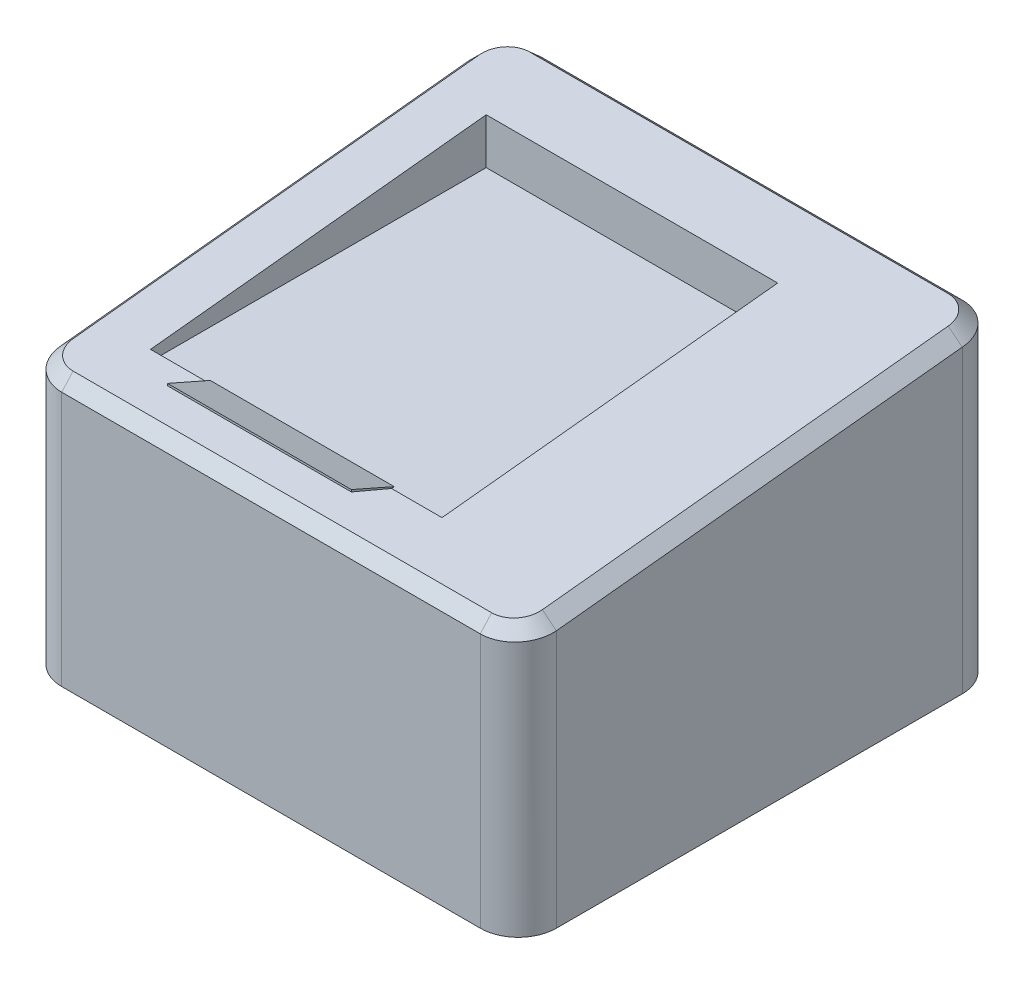
ISO-10303-21;
HEADER;
FILE_DESCRIPTION(('STEP AP214'),'2;1');
FILE_NAME('part.step','',(''),(''),'','','');
FILE_SCHEMA(('AUTOMOTIVE_DESIGN { 1 0 10303 214 1 1 1 1 }'));
ENDSEC;
DATA;
#1=APPLICATION_CONTEXT('core data for automotive mechanical design processes');
#2=APPLICATION_PROTOCOL_DEFINITION('international standard','automotive_design',2000,#1);
#3=PRODUCT_CONTEXT('',#1,'mechanical');
#4=PRODUCT('Part','Part','',(#3));
#5=PRODUCT_RELATED_PRODUCT_CATEGORY('part','',(#4));
#6=PRODUCT_DEFINITION_FORMATION('','',#4);
#7=PRODUCT_DEFINITION_CONTEXT('part definition',#1,'design');
#8=PRODUCT_DEFINITION('design','',#6,#7);
#9=PRODUCT_DEFINITION_SHAPE('','',#8);
#10=(LENGTH_UNIT() NAMED_UNIT(*) SI_UNIT(.MILLI.,.METRE.));
#11=(NAMED_UNIT(*) PLANE_ANGLE_UNIT() SI_UNIT($,.RADIAN.));
#12=(NAMED_UNIT(*) SI_UNIT($,.STERADIAN.) SOLID_ANGLE_UNIT());
#13=UNCERTAINTY_MEASURE_WITH_UNIT(LENGTH_MEASURE(1.E-05),#10,'distance_accuracy_value','');
#14=(GEOMETRIC_REPRESENTATION_CONTEXT(3) GLOBAL_UNCERTAINTY_ASSIGNED_CONTEXT((#13)) GLOBAL_UNIT_ASSIGNED_CONTEXT((#10,
#11,#12)) REPRESENTATION_CONTEXT('',''));
#15=CARTESIAN_POINT('',(0.,0.,0.));
#16=DIRECTION('',(0.,0.,1.));
#17=DIRECTION('',(1.,0.,0.));
#18=AXIS2_PLACEMENT_3D('',#15,#16,#17);
#19=CARTESIAN_POINT('',(-100.,215.485626080053,137.886552239496));
#20=DIRECTION('',(0.,-0.994505452921406,-0.104684784518048));
#21=DIRECTION('',(0.,0.104684784518048,-0.994505452921406));
#22=AXIS2_PLACEMENT_3D('',#19,#20,#21);
#23=PLANE('',#22);
#24=DIRECTION('',(1.,0.,0.));
#25=VECTOR('',#24,1.);
#26=CARTESIAN_POINT('',(-100.,215.485626080053,137.886552239496));
#27=LINE('',#26,#25);
#28=CARTESIAN_POINT('',(-100.,215.485626080053,137.886552239496));
#29=VERTEX_POINT('',#28);
#30=CARTESIAN_POINT('',(45.,215.485626080053,137.886552239496));
#31=VERTEX_POINT('',#30);
#32=EDGE_CURVE('E51',#29,#31,#27,.T.);
#33=ORIENTED_EDGE('',*,*,#32,.T.);
#34=DIRECTION('',(0.,0.104684784518048,-0.994505452921405));
#35=VECTOR('',#34,1.);
#36=CARTESIAN_POINT('',(45.,215.485626080053,137.886552239496));
#37=LINE('',#36,#35);
#38=CARTESIAN_POINT('',(45.,215.263157894737,140.));
#39=VERTEX_POINT('',#38);
#40=EDGE_CURVE('E88',#39,#31,#37,.T.);
#41=ORIENTED_EDGE('',*,*,#40,.F.);
#42=DIRECTION('',(1.,0.,0.));
#43=VECTOR('',#42,1.);
#44=CARTESIAN_POINT('',(-100.,215.263157894737,140.));
#45=LINE('',#44,#43);
#46=CARTESIAN_POINT('',(-100.,215.263157894737,140.));
#47=VERTEX_POINT('',#46);
#48=EDGE_CURVE('E12',#47,#39,#45,.T.);
#49=ORIENTED_EDGE('',*,*,#48,.F.);
#50=DIRECTION('',(0.,0.104684784518048,-0.994505452921405));
#51=VECTOR('',#50,1.);
#52=CARTESIAN_POINT('',(-100.,215.485626080053,137.886552239496));
#53=LINE('',#52,#51);
#54=EDGE_CURVE('E89',#47,#29,#53,.T.);
#55=ORIENTED_EDGE('',*,*,#54,.T.);
#56=EDGE_LOOP('',(#33,#41,#49,#55));
#57=FACE_BOUND('',#56,.T.);
#58=ADVANCED_FACE('F48',(#57),#23,.T.);
#59=CARTESIAN_POINT('',(-100.,215.263157894737,140.));
#60=DIRECTION('',(0.,-0.920273137983253,0.391276566518436));
#61=DIRECTION('',(0.,-0.391276566518436,-0.920273137983253));
#62=AXIS2_PLACEMENT_3D('',#59,#60,#61);
#63=PLANE('',#62);
#64=ORIENTED_EDGE('',*,*,#48,.T.);
#65=DIRECTION('',(0.,-0.391276566518436,-0.920273137983253));
#66=VECTOR('',#65,1.);
#67=CARTESIAN_POINT('',(45.,215.263157894737,140.));
#68=LINE('',#67,#66);
#69=CARTESIAN_POINT('',(45.,228.713079158669,171.63389353296));
#70=VERTEX_POINT('',#69);
#71=EDGE_CURVE('E105',#70,#39,#68,.T.);
#72=ORIENTED_EDGE('',*,*,#71,.F.);
#73=DIRECTION('',(1.,0.,0.));
#74=VECTOR('',#73,1.);
#75=CARTESIAN_POINT('',(-100.,228.713079158669,171.63389353296));
#76=LINE('',#75,#74);
#77=CARTESIAN_POINT('',(-100.,228.713079158669,171.63389353296));
#78=VERTEX_POINT('',#77);
#79=EDGE_CURVE('E56',#78,#70,#76,.T.);
#80=ORIENTED_EDGE('',*,*,#79,.F.);
#81=DIRECTION('',(0.,-0.391276566518436,-0.920273137983253));
#82=VECTOR('',#81,1.);
#83=CARTESIAN_POINT('',(-100.,215.263157894737,140.));
#84=LINE('',#83,#82);
#85=EDGE_CURVE('E94',#78,#47,#84,.T.);
#86=ORIENTED_EDGE('',*,*,#85,.T.);
#87=EDGE_LOOP('',(#64,#72,#80,#86));
#88=FACE_BOUND('',#87,.T.);
#89=ADVANCED_FACE('F120',(#88),#63,.T.);
#90=CARTESIAN_POINT('',(-100.,228.713079158669,171.63389353296));
#91=DIRECTION('',(0.,0.,1.));
#92=DIRECTION('',(0.,-1.,0.));
#93=AXIS2_PLACEMENT_3D('',#90,#91,#92);
#94=PLANE('',#93);
#95=ORIENTED_EDGE('',*,*,#79,.T.);
#96=DIRECTION('',(0.,-1.,0.));
#97=VECTOR('',#96,1.);
#98=CARTESIAN_POINT('',(45.,228.713079158669,171.63389353296));
#99=LINE('',#98,#97);
#100=CARTESIAN_POINT('',(45.,230.345676999978,171.63389353296));
#101=VERTEX_POINT('',#100);
#102=EDGE_CURVE('E101',#101,#70,#99,.T.);
#103=ORIENTED_EDGE('',*,*,#102,.F.);
#104=DIRECTION('',(1.,0.,0.));
#105=VECTOR('',#104,1.);
#106=CARTESIAN_POINT('',(-100.,230.345676999978,171.63389353296));
#107=LINE('',#106,#105);
#108=CARTESIAN_POINT('',(-100.,230.345676999978,171.63389353296));
#109=VERTEX_POINT('',#108);
#110=EDGE_CURVE('E93',#109,#101,#107,.T.);
#111=ORIENTED_EDGE('',*,*,#110,.F.);
#112=DIRECTION('',(0.,-1.,0.));
#113=VECTOR('',#112,1.);
#114=CARTESIAN_POINT('',(-100.,228.713079158669,171.63389353296));
#115=LINE('',#114,#113);
#116=EDGE_CURVE('E113',#109,#78,#115,.T.);
#117=ORIENTED_EDGE('',*,*,#116,.T.);
#118=EDGE_LOOP('',(#95,#103,#111,#117));
#119=FACE_BOUND('',#118,.T.);
#120=ADVANCED_FACE('F117',(#119),#94,.T.);
#121=CARTESIAN_POINT('',(-100.,230.345676999978,171.63389353296));
#122=DIRECTION('',(0.,0.915202822566064,-0.402993540354072));
#123=DIRECTION('',(0.,0.402993540354072,0.915202822566064));
#124=AXIS2_PLACEMENT_3D('',#121,#122,#123);
#125=PLANE('',#124);
#126=ORIENTED_EDGE('',*,*,#110,.T.);
#127=DIRECTION('',(0.,0.402993540354072,0.915202822566064));
#128=VECTOR('',#127,1.);
#129=CARTESIAN_POINT('',(45.,230.345676999978,171.63389353296));
#130=LINE('',#129,#128);
#131=EDGE_CURVE('E96',#31,#101,#130,.T.);
#132=ORIENTED_EDGE('',*,*,#131,.F.);
#133=ORIENTED_EDGE('',*,*,#32,.F.);
#134=DIRECTION('',(0.,0.402993540354072,0.915202822566064));
#135=VECTOR('',#134,1.);
#136=CARTESIAN_POINT('',(-100.,230.345676999978,171.63389353296));
#137=LINE('',#136,#135);
#138=EDGE_CURVE('E111',#29,#109,#137,.T.);
#139=ORIENTED_EDGE('',*,*,#138,.T.);
#140=EDGE_LOOP('',(#126,#132,#133,#139));
#141=FACE_BOUND('',#140,.T.);
#142=ADVANCED_FACE('F97',(#141),#125,.T.);
#143=CARTESIAN_POINT('',(-100.,211.933274364951,171.63389353296));
#144=DIRECTION('',(-1.,0.,0.));
#145=DIRECTION('',(0.,0.,1.));
#146=AXIS2_PLACEMENT_3D('',#143,#144,#145);
#147=PLANE('',#146);
#148=ORIENTED_EDGE('',*,*,#54,.F.);
#149=ORIENTED_EDGE('',*,*,#85,.F.);
#150=ORIENTED_EDGE('',*,*,#116,.F.);
#151=ORIENTED_EDGE('',*,*,#138,.F.);
#152=EDGE_LOOP('',(#148,#149,#150,#151));
#153=FACE_BOUND('',#152,.T.);
#154=ADVANCED_FACE('F122',(#153),#147,.T.);
#155=CARTESIAN_POINT('',(45.,211.933274364951,171.63389353296));
#156=DIRECTION('',(-1.,0.,0.));
#157=DIRECTION('',(0.,0.,1.));
#158=AXIS2_PLACEMENT_3D('',#155,#156,#157);
#159=PLANE('',#158);
#160=ORIENTED_EDGE('',*,*,#40,.T.);
#161=ORIENTED_EDGE('',*,*,#131,.T.);
#162=ORIENTED_EDGE('',*,*,#102,.T.);
#163=ORIENTED_EDGE('',*,*,#71,.T.);
#164=EDGE_LOOP('',(#160,#161,#162,#163));
#165=FACE_BOUND('',#164,.T.);
#166=ADVANCED_FACE('F104',(#165),#159,.F.);
#167=CLOSED_SHELL('',(#58,#89,#120,#142,#154,#166));
#168=MANIFOLD_SOLID_BREP('B2',#167);
#169=CARTESIAN_POINT('',(195.,250.,190.));
#170=DIRECTION('',(-1.,0.,0.));
#171=DIRECTION('',(0.,0.,1.));
#172=AXIS2_PLACEMENT_3D('',#169,#170,#171);
#173=PLANE('',#172);
#174=DIRECTION('',(0.,-1.,0.));
#175=VECTOR('',#174,1.);
#176=CARTESIAN_POINT('',(195.,250.,-160.));
#177=LINE('',#176,#175);
#178=CARTESIAN_POINT('',(195.,0.,-160.));
#179=VERTEX_POINT('',#178);
#180=CARTESIAN_POINT('',(195.,236.786856223925,-160.));
#181=VERTEX_POINT('',#180);
#182=EDGE_CURVE('E402',#179,#181,#177,.F.);
#183=ORIENTED_EDGE('',*,*,#182,.T.);
#184=DIRECTION('',(0.,-0.104684784518043,0.994505452921406));
#185=VECTOR('',#184,1.);
#186=CARTESIAN_POINT('',(195.,203.212840207628,158.95315215482));
#187=LINE('',#186,#185);
#188=CARTESIAN_POINT('',(195.,203.102645697609,160.));
#189=VERTEX_POINT('',#188);
#190=EDGE_CURVE('E750',#181,#189,#187,.T.);
#191=ORIENTED_EDGE('',*,*,#190,.T.);
#192=DIRECTION('',(0.,-1.,0.));
#193=VECTOR('',#192,1.);
#194=CARTESIAN_POINT('',(195.,250.,160.));
#195=LINE('',#194,#193);
#196=CARTESIAN_POINT('',(195.,0.,160.));
#197=VERTEX_POINT('',#196);
#198=EDGE_CURVE('E753',#189,#197,#195,.T.);
#199=ORIENTED_EDGE('',*,*,#198,.T.);
#200=DIRECTION('',(0.,0.,-1.));
#201=VECTOR('',#200,1.);
#202=CARTESIAN_POINT('',(195.,0.,190.));
#203=LINE('',#202,#201);
#204=EDGE_CURVE('E337',#197,#179,#203,.T.);
#205=ORIENTED_EDGE('',*,*,#204,.T.);
#206=EDGE_LOOP('',(#183,#191,#199,#205));
#207=FACE_BOUND('',#206,.T.);
#208=ADVANCED_FACE('F183',(#207),#173,.F.);
#209=CARTESIAN_POINT('',(-195.,250.,190.));
#210=DIRECTION('',(1.,0.,0.));
#211=DIRECTION('',(0.,0.,-1.));
#212=AXIS2_PLACEMENT_3D('',#209,#210,#211);
#213=PLANE('',#212);
#214=DIRECTION('',(0.,-1.,0.));
#215=VECTOR('',#214,1.);
#216=CARTESIAN_POINT('',(-195.,250.,160.));
#217=LINE('',#216,#215);
#218=CARTESIAN_POINT('',(-195.,0.,160.));
#219=VERTEX_POINT('',#218);
#220=CARTESIAN_POINT('',(-195.,203.102645697609,160.));
#221=VERTEX_POINT('',#220);
#222=EDGE_CURVE('E378',#219,#221,#217,.F.);
#223=ORIENTED_EDGE('',*,*,#222,.T.);
#224=DIRECTION('',(0.,0.104684784518043,-0.994505452921406));
#225=VECTOR('',#224,1.);
#226=CARTESIAN_POINT('',(-195.,236.897050733944,-161.04684784518));
#227=LINE('',#226,#225);
#228=CARTESIAN_POINT('',(-195.,236.786856223925,-160.));
#229=VERTEX_POINT('',#228);
#230=EDGE_CURVE('E46',#221,#229,#227,.T.);
#231=ORIENTED_EDGE('',*,*,#230,.T.);
#232=DIRECTION('',(0.,-1.,0.));
#233=VECTOR('',#232,1.);
#234=CARTESIAN_POINT('',(-195.,250.,-160.));
#235=LINE('',#234,#233);
#236=CARTESIAN_POINT('',(-195.,0.,-160.));
#237=VERTEX_POINT('',#236);
#238=EDGE_CURVE('E374',#229,#237,#235,.T.);
#239=ORIENTED_EDGE('',*,*,#238,.T.);
#240=DIRECTION('',(0.,0.,1.));
#241=VECTOR('',#240,1.);
#242=CARTESIAN_POINT('',(-195.,0.,190.));
#243=LINE('',#242,#241);
#244=EDGE_CURVE('E347',#237,#219,#243,.T.);
#245=ORIENTED_EDGE('',*,*,#244,.T.);
#246=EDGE_LOOP('',(#223,#231,#239,#245));
#247=FACE_BOUND('',#246,.T.);
#248=ADVANCED_FACE('F725',(#247),#213,.F.);
#249=CARTESIAN_POINT('',(-195.,250.,190.));
#250=DIRECTION('',(0.,0.,-1.));
#251=DIRECTION('',(-1.,0.,0.));
#252=AXIS2_PLACEMENT_3D('',#249,#250,#251);
#253=PLANE('',#252);
#254=DIRECTION('',(0.,-1.,0.));
#255=VECTOR('',#254,1.);
#256=CARTESIAN_POINT('',(165.,250.,190.));
#257=LINE('',#256,#255);
#258=CARTESIAN_POINT('',(165.,0.,190.));
#259=VERTEX_POINT('',#258);
#260=CARTESIAN_POINT('',(165.,200.997382539714,190.));
#261=VERTEX_POINT('',#260);
#262=EDGE_CURVE('E393',#259,#261,#257,.F.);
#263=ORIENTED_EDGE('',*,*,#262,.T.);
#264=DIRECTION('',(-1.,0.,0.));
#265=VECTOR('',#264,1.);
#266=CARTESIAN_POINT('',(-165.,200.997382539714,190.));
#267=LINE('',#266,#265);
#268=CARTESIAN_POINT('',(-165.,200.997382539714,190.));
#269=VERTEX_POINT('',#268);
#270=EDGE_CURVE('E212',#261,#269,#267,.T.);
#271=ORIENTED_EDGE('',*,*,#270,.T.);
#272=DIRECTION('',(0.,-1.,0.));
#273=VECTOR('',#272,1.);
#274=CARTESIAN_POINT('',(-165.,250.,190.));
#275=LINE('',#274,#273);
#276=CARTESIAN_POINT('',(-165.,0.,190.));
#277=VERTEX_POINT('',#276);
#278=EDGE_CURVE('E377',#269,#277,#275,.T.);
#279=ORIENTED_EDGE('',*,*,#278,.T.);
#280=DIRECTION('',(1.,0.,0.));
#281=VECTOR('',#280,1.);
#282=CARTESIAN_POINT('',(-195.,0.,190.));
#283=LINE('',#282,#281);
#284=EDGE_CURVE('E350',#277,#259,#283,.T.);
#285=ORIENTED_EDGE('',*,*,#284,.T.);
#286=EDGE_LOOP('',(#263,#271,#279,#285));
#287=FACE_BOUND('',#286,.T.);
#288=ADVANCED_FACE('F743',(#287),#253,.F.);
#289=CARTESIAN_POINT('',(-195.,250.,-190.));
#290=DIRECTION('',(0.,0.,1.));
#291=DIRECTION('',(1.,0.,0.));
#292=AXIS2_PLACEMENT_3D('',#289,#290,#291);
#293=PLANE('',#292);
#294=DIRECTION('',(0.,-1.,0.));
#295=VECTOR('',#294,1.);
#296=CARTESIAN_POINT('',(-165.,250.,-190.));
#297=LINE('',#296,#295);
#298=CARTESIAN_POINT('',(-165.,0.,-190.));
#299=VERTEX_POINT('',#298);
#300=CARTESIAN_POINT('',(-165.,238.89211938182,-190.));
#301=VERTEX_POINT('',#300);
#302=EDGE_CURVE('E360',#299,#301,#297,.F.);
#303=ORIENTED_EDGE('',*,*,#302,.T.);
#304=DIRECTION('',(1.,0.,0.));
#305=VECTOR('',#304,1.);
#306=CARTESIAN_POINT('',(165.,238.89211938182,-190.));
#307=LINE('',#306,#305);
#308=CARTESIAN_POINT('',(165.,238.89211938182,-190.));
#309=VERTEX_POINT('',#308);
#310=EDGE_CURVE('E773',#301,#309,#307,.T.);
#311=ORIENTED_EDGE('',*,*,#310,.T.);
#312=DIRECTION('',(0.,-1.,0.));
#313=VECTOR('',#312,1.);
#314=CARTESIAN_POINT('',(165.,250.,-190.));
#315=LINE('',#314,#313);
#316=CARTESIAN_POINT('',(165.,0.,-190.));
#317=VERTEX_POINT('',#316);
#318=EDGE_CURVE('E369',#309,#317,#315,.T.);
#319=ORIENTED_EDGE('',*,*,#318,.T.);
#320=DIRECTION('',(-1.,0.,0.));
#321=VECTOR('',#320,1.);
#322=CARTESIAN_POINT('',(-195.,0.,-190.));
#323=LINE('',#322,#321);
#324=EDGE_CURVE('E344',#317,#299,#323,.T.);
#325=ORIENTED_EDGE('',*,*,#324,.T.);
#326=EDGE_LOOP('',(#303,#311,#319,#325));
#327=FACE_BOUND('',#326,.T.);
#328=ADVANCED_FACE('F776',(#327),#293,.F.);
#329=CARTESIAN_POINT('',(195.,0.,-190.));
#330=DIRECTION('',(0.,-1.,0.));
#331=DIRECTION('',(0.,0.,-1.));
#332=AXIS2_PLACEMENT_3D('',#329,#330,#331);
#333=PLANE('',#332);
#334=ORIENTED_EDGE('',*,*,#324,.F.);
#335=CARTESIAN_POINT('',(165.,0.,-160.));
#336=DIRECTION('',(0.,-1.,0.));
#337=DIRECTION('',(0.,0.,-1.));
#338=AXIS2_PLACEMENT_3D('',#335,#336,#337);
#339=CIRCLE('',#338,30.);
#340=EDGE_CURVE('E734',#317,#179,#339,.T.);
#341=ORIENTED_EDGE('',*,*,#340,.T.);
#342=ORIENTED_EDGE('',*,*,#204,.F.);
#343=CARTESIAN_POINT('',(165.,0.,160.));
#344=DIRECTION('',(0.,-1.,0.));
#345=DIRECTION('',(0.,0.,-1.));
#346=AXIS2_PLACEMENT_3D('',#343,#344,#345);
#347=CIRCLE('',#346,30.);
#348=EDGE_CURVE('E735',#197,#259,#347,.T.);
#349=ORIENTED_EDGE('',*,*,#348,.T.);
#350=ORIENTED_EDGE('',*,*,#284,.F.);
#351=CARTESIAN_POINT('',(-165.,0.,160.));
#352=DIRECTION('',(0.,-1.,0.));
#353=DIRECTION('',(0.,0.,-1.));
#354=AXIS2_PLACEMENT_3D('',#351,#352,#353);
#355=CIRCLE('',#354,30.);
#356=EDGE_CURVE('E739',#277,#219,#355,.T.);
#357=ORIENTED_EDGE('',*,*,#356,.T.);
#358=ORIENTED_EDGE('',*,*,#244,.F.);
#359=CARTESIAN_POINT('',(-165.,0.,-160.));
#360=DIRECTION('',(0.,-1.,0.));
#361=DIRECTION('',(0.,0.,-1.));
#362=AXIS2_PLACEMENT_3D('',#359,#360,#361);
#363=CIRCLE('',#362,30.);
#364=EDGE_CURVE('E730',#237,#299,#363,.T.);
#365=ORIENTED_EDGE('',*,*,#364,.T.);
#366=EDGE_LOOP('',(#334,#341,#342,#349,#350,#357,#358,#365));
#367=FACE_BOUND('',#366,.T.);
#368=ADVANCED_FACE('F668',(#367),#333,.T.);
#369=CARTESIAN_POINT('',(250.,210.,190.));
#370=DIRECTION('',(0.,0.994505452921406,0.104684784518043));
#371=DIRECTION('',(0.,-0.104684784518043,0.994505452921406));
#372=AXIS2_PLACEMENT_3D('',#369,#370,#371);
#373=PLANE('',#372);
#374=DIRECTION('',(-1.,0.,0.));
#375=VECTOR('',#374,1.);
#376=CARTESIAN_POINT('',(-165.,248.837173911034,-178.95315215482));
#377=LINE('',#376,#375);
#378=CARTESIAN_POINT('',(165.,248.837173911034,-178.95315215482));
#379=VERTEX_POINT('',#378);
#380=CARTESIAN_POINT('',(-165.,248.837173911034,-178.95315215482));
#381=VERTEX_POINT('',#380);
#382=EDGE_CURVE('E649',#379,#381,#377,.T.);
#383=ORIENTED_EDGE('',*,*,#382,.T.);
#384=CARTESIAN_POINT('',(-185.,246.731910753139,-158.95315215482));
#385=CARTESIAN_POINT('',(-185.001394210175,247.007513573576,-161.571378948976));
#386=CARTESIAN_POINT('',(-184.479542807475,247.28293624371,-164.187894315242));
#387=CARTESIAN_POINT('',(-182.475638492977,247.792183925158,-169.025747289001));
#388=CARTESIAN_POINT('',(-180.99350180704,248.025675957394,-171.243921595242));
#389=CARTESIAN_POINT('',(-177.290769440422,248.415437259143,-174.946653961859));
#390=CARTESIAN_POINT('',(-175.072595139526,248.571451646903,-176.428790645583));
#391=CARTESIAN_POINT('',(-170.234742155078,248.782388943632,-178.432694964508));
#392=CARTESIAN_POINT('',(-167.618226794156,248.837320669999,-178.954546364995));
#393=CARTESIAN_POINT('',(-165.,248.837173911034,-178.95315215482));
#394=B_SPLINE_CURVE_WITH_KNOTS('',3,(#384,#385,#386,#387,#388,#389,#390,#391,#392,#393),
.UNSPECIFIED.,.F.,.F.,(4,2,2,2,4),(3.14159265358979,3.53429173528852,3.92699081698724,
4.31968989868597,4.71238898038469),.UNSPECIFIED.);
#395=CARTESIAN_POINT('',(-185.,246.731910753139,-158.95315215482));
#396=VERTEX_POINT('',#395);
#397=EDGE_CURVE('E642',#381,#396,#394,.F.);
#398=ORIENTED_EDGE('',*,*,#397,.T.);
#399=DIRECTION('',(0.,-0.104684784518043,0.994505452921406));
#400=VECTOR('',#399,1.);
#401=CARTESIAN_POINT('',(-185.,213.157894736842,160.));
#402=LINE('',#401,#400);
#403=CARTESIAN_POINT('',(-185.,213.047700226823,161.04684784518));
#404=VERTEX_POINT('',#403);
#405=EDGE_CURVE('E644',#396,#404,#402,.T.);
#406=ORIENTED_EDGE('',*,*,#405,.T.);
#407=CARTESIAN_POINT('',(-165.,210.942437068928,181.04684784518));
#408=CARTESIAN_POINT('',(-167.618226794156,210.942290309963,181.048242055356));
#409=CARTESIAN_POINT('',(-170.234742155078,210.99722203633,180.526390654869));
#410=CARTESIAN_POINT('',(-175.072595139526,211.208159333059,178.522486335943));
#411=CARTESIAN_POINT('',(-177.290769440422,211.364173720819,177.04034965222));
#412=CARTESIAN_POINT('',(-180.99350180704,211.753935022568,173.337617285602));
#413=CARTESIAN_POINT('',(-182.475638492977,211.987427054804,171.119442979361));
#414=CARTESIAN_POINT('',(-184.479542807475,212.496674736252,166.281590005603));
#415=CARTESIAN_POINT('',(-185.001394210175,212.772097406386,163.665074639336));
#416=CARTESIAN_POINT('',(-185.,213.047700226823,161.04684784518));
#417=B_SPLINE_CURVE_WITH_KNOTS('',3,(#407,#408,#409,#410,#411,#412,#413,#414,#415,#416),
.UNSPECIFIED.,.F.,.F.,(4,2,2,2,4),(4.71238898038469,5.10508806208341,5.49778714378214,
5.89048622548086,6.28318530717959),.UNSPECIFIED.);
#418=CARTESIAN_POINT('',(-165.,210.942437068928,181.04684784518));
#419=VERTEX_POINT('',#418);
#420=EDGE_CURVE('E645',#404,#419,#417,.F.);
#421=ORIENTED_EDGE('',*,*,#420,.T.);
#422=DIRECTION('',(1.,0.,0.));
#423=VECTOR('',#422,1.);
#424=CARTESIAN_POINT('',(165.,210.942437068928,181.04684784518));
#425=LINE('',#424,#423);
#426=CARTESIAN_POINT('',(165.,210.942437068928,181.04684784518));
#427=VERTEX_POINT('',#426);
#428=EDGE_CURVE('E600',#419,#427,#425,.T.);
#429=ORIENTED_EDGE('',*,*,#428,.T.);
#430=CARTESIAN_POINT('',(185.,213.047700226823,161.04684784518));
#431=CARTESIAN_POINT('',(185.001394210175,212.772097406386,163.665074639336));
#432=CARTESIAN_POINT('',(184.479542807475,212.496674736252,166.281590005603));
#433=CARTESIAN_POINT('',(182.475638492977,211.987427054804,171.119442979361));
#434=CARTESIAN_POINT('',(180.99350180704,211.753935022568,173.337617285603));
#435=CARTESIAN_POINT('',(177.290769440422,211.364173720819,177.04034965222));
#436=CARTESIAN_POINT('',(175.072595139525,211.208159333059,178.522486335944));
#437=CARTESIAN_POINT('',(170.234742155078,210.99722203633,180.526390654869));
#438=CARTESIAN_POINT('',(167.618226794156,210.942290309962,181.048242055356));
#439=CARTESIAN_POINT('',(165.,210.942437068928,181.04684784518));
#440=B_SPLINE_CURVE_WITH_KNOTS('',3,(#430,#431,#432,#433,#434,#435,#436,#437,#438,#439),
.UNSPECIFIED.,.F.,.F.,(4,2,2,2,4),(0.,0.392699081698723,0.785398163397447,1.17809724509617,
1.5707963267949),.UNSPECIFIED.);
#441=CARTESIAN_POINT('',(185.,213.047700226823,161.04684784518));
#442=VERTEX_POINT('',#441);
#443=EDGE_CURVE('E594',#427,#442,#440,.F.);
#444=ORIENTED_EDGE('',*,*,#443,.T.);
#445=DIRECTION('',(0.,0.104684784518043,-0.994505452921406));
#446=VECTOR('',#445,1.);
#447=CARTESIAN_POINT('',(185.,246.842105263158,-160.));
#448=LINE('',#447,#446);
#449=CARTESIAN_POINT('',(185.,246.731910753139,-158.95315215482));
#450=VERTEX_POINT('',#449);
#451=EDGE_CURVE('E599',#442,#450,#448,.T.);
#452=ORIENTED_EDGE('',*,*,#451,.T.);
#453=CARTESIAN_POINT('',(165.,248.837173911034,-178.95315215482));
#454=CARTESIAN_POINT('',(167.618226794156,248.837320669999,-178.954546364995));
#455=CARTESIAN_POINT('',(170.234742155078,248.782388943632,-178.432694964508));
#456=CARTESIAN_POINT('',(175.072595139525,248.571451646903,-176.428790645583));
#457=CARTESIAN_POINT('',(177.290769440422,248.415437259143,-174.946653961859));
#458=CARTESIAN_POINT('',(180.99350180704,248.025675957394,-171.243921595242));
#459=CARTESIAN_POINT('',(182.475638492977,247.792183925158,-169.025747289001));
#460=CARTESIAN_POINT('',(184.479542807475,247.28293624371,-164.187894315242));
#461=CARTESIAN_POINT('',(185.001394210175,247.007513573576,-161.571378948975));
#462=CARTESIAN_POINT('',(185.,246.731910753139,-158.95315215482));
#463=B_SPLINE_CURVE_WITH_KNOTS('',3,(#453,#454,#455,#456,#457,#458,#459,#460,#461,#462),
.UNSPECIFIED.,.F.,.F.,(4,2,2,2,4),(1.5707963267949,1.96349540849362,2.35619449019235,
2.74889357189107,3.14159265358979),.UNSPECIFIED.);
#464=EDGE_CURVE('E654',#450,#379,#463,.F.);
#465=ORIENTED_EDGE('',*,*,#464,.T.);
#466=EDGE_LOOP('',(#383,#398,#406,#421,#429,#444,#452,#465));
#467=FACE_BOUND('',#466,.T.);
#468=DIRECTION('',(0.,-0.104684784518043,0.994505452921406));
#469=VECTOR('',#468,1.);
#470=CARTESIAN_POINT('',(-145.,210.,190.));
#471=LINE('',#470,#469);
#472=CARTESIAN_POINT('',(-145.,243.123011405355,-124.668608350873));
#473=VERTEX_POINT('',#472);
#474=CARTESIAN_POINT('',(-145.,215.263157894737,140.));
#475=VERTEX_POINT('',#474);
#476=EDGE_CURVE('E311',#473,#475,#471,.T.);
#477=ORIENTED_EDGE('',*,*,#476,.F.);
#478=DIRECTION('',(-1.,0.,0.));
#479=VECTOR('',#478,1.);
#480=CARTESIAN_POINT('',(250.,243.123011405355,-124.668608350873));
#481=LINE('',#480,#479);
#482=CARTESIAN_POINT('',(84.795699229561,243.123011405355,-124.668608350873));
#483=VERTEX_POINT('',#482);
#484=EDGE_CURVE('E357',#483,#473,#481,.T.);
#485=ORIENTED_EDGE('',*,*,#484,.F.);
#486=DIRECTION('',(0.,0.104684784518043,-0.994505452921406));
#487=VECTOR('',#486,1.);
#488=CARTESIAN_POINT('',(84.795699229561,210.,190.));
#489=LINE('',#488,#487);
#490=CARTESIAN_POINT('',(84.795699229561,215.263157894737,140.));
#491=VERTEX_POINT('',#490);
#492=EDGE_CURVE('E355',#491,#483,#489,.T.);
#493=ORIENTED_EDGE('',*,*,#492,.F.);
#494=DIRECTION('',(1.,0.,0.));
#495=VECTOR('',#494,1.);
#496=CARTESIAN_POINT('',(250.,215.263157894737,140.));
#497=LINE('',#496,#495);
#498=EDGE_CURVE('E353',#475,#491,#497,.T.);
#499=ORIENTED_EDGE('',*,*,#498,.F.);
#500=EDGE_LOOP('',(#477,#485,#493,#499));
#501=FACE_BOUND('',#500,.T.);
#502=ADVANCED_FACE('F647',(#467,#501),#373,.T.);
#503=CARTESIAN_POINT('',(-145.,207.,140.));
#504=DIRECTION('',(-1.,0.,0.));
#505=DIRECTION('',(0.,0.,1.));
#506=AXIS2_PLACEMENT_3D('',#503,#504,#505);
#507=PLANE('',#506);
#508=ORIENTED_EDGE('',*,*,#476,.T.);
#509=DIRECTION('',(0.,1.,0.));
#510=VECTOR('',#509,1.);
#511=CARTESIAN_POINT('',(-145.,207.,140.));
#512=LINE('',#511,#510);
#513=CARTESIAN_POINT('',(-145.,207.,140.));
#514=VERTEX_POINT('',#513);
#515=EDGE_CURVE('E303',#514,#475,#512,.T.);
#516=ORIENTED_EDGE('',*,*,#515,.F.);
#517=DIRECTION('',(0.,0.,1.));
#518=VECTOR('',#517,1.);
#519=CARTESIAN_POINT('',(-145.,207.,140.));
#520=LINE('',#519,#518);
#521=CARTESIAN_POINT('',(-145.,207.,-124.668608350873));
#522=VERTEX_POINT('',#521);
#523=EDGE_CURVE('E308',#522,#514,#520,.T.);
#524=ORIENTED_EDGE('',*,*,#523,.F.);
#525=DIRECTION('',(0.,1.,0.));
#526=VECTOR('',#525,1.);
#527=CARTESIAN_POINT('',(-145.,207.,-124.668608350873));
#528=LINE('',#527,#526);
#529=EDGE_CURVE('E335',#522,#473,#528,.T.);
#530=ORIENTED_EDGE('',*,*,#529,.T.);
#531=EDGE_LOOP('',(#508,#516,#524,#530));
#532=FACE_BOUND('',#531,.T.);
#533=ADVANCED_FACE('F305',(#532),#507,.F.);
#534=CARTESIAN_POINT('',(84.795699229561,207.,-124.668608350873));
#535=DIRECTION('',(0.,0.,-1.));
#536=DIRECTION('',(-1.,0.,0.));
#537=AXIS2_PLACEMENT_3D('',#534,#535,#536);
#538=PLANE('',#537);
#539=ORIENTED_EDGE('',*,*,#484,.T.);
#540=ORIENTED_EDGE('',*,*,#529,.F.);
#541=DIRECTION('',(-1.,0.,0.));
#542=VECTOR('',#541,1.);
#543=CARTESIAN_POINT('',(84.795699229561,207.,-124.668608350873));
#544=LINE('',#543,#542);
#545=CARTESIAN_POINT('',(84.795699229561,207.,-124.668608350873));
#546=VERTEX_POINT('',#545);
#547=EDGE_CURVE('E315',#546,#522,#544,.T.);
#548=ORIENTED_EDGE('',*,*,#547,.F.);
#549=DIRECTION('',(0.,1.,0.));
#550=VECTOR('',#549,1.);
#551=CARTESIAN_POINT('',(84.795699229561,207.,-124.668608350873));
#552=LINE('',#551,#550);
#553=EDGE_CURVE('E338',#546,#483,#552,.T.);
#554=ORIENTED_EDGE('',*,*,#553,.T.);
#555=EDGE_LOOP('',(#539,#540,#548,#554));
#556=FACE_BOUND('',#555,.T.);
#557=ADVANCED_FACE('F823',(#556),#538,.F.);
#558=CARTESIAN_POINT('',(84.795699229561,207.,140.));
#559=DIRECTION('',(1.,0.,0.));
#560=DIRECTION('',(0.,0.,-1.));
#561=AXIS2_PLACEMENT_3D('',#558,#559,#560);
#562=PLANE('',#561);
#563=ORIENTED_EDGE('',*,*,#492,.T.);
#564=ORIENTED_EDGE('',*,*,#553,.F.);
#565=DIRECTION('',(0.,0.,-1.));
#566=VECTOR('',#565,1.);
#567=CARTESIAN_POINT('',(84.795699229561,207.,140.));
#568=LINE('',#567,#566);
#569=CARTESIAN_POINT('',(84.795699229561,207.,140.));
#570=VERTEX_POINT('',#569);
#571=EDGE_CURVE('E324',#570,#546,#568,.T.);
#572=ORIENTED_EDGE('',*,*,#571,.F.);
#573=DIRECTION('',(0.,1.,0.));
#574=VECTOR('',#573,1.);
#575=CARTESIAN_POINT('',(84.795699229561,207.,140.));
#576=LINE('',#575,#574);
#577=EDGE_CURVE('E314',#570,#491,#576,.T.);
#578=ORIENTED_EDGE('',*,*,#577,.T.);
#579=EDGE_LOOP('',(#563,#564,#572,#578));
#580=FACE_BOUND('',#579,.T.);
#581=ADVANCED_FACE('F829',(#580),#562,.F.);
#582=CARTESIAN_POINT('',(84.795699229561,207.,140.));
#583=DIRECTION('',(0.,0.,1.));
#584=DIRECTION('',(1.,0.,0.));
#585=AXIS2_PLACEMENT_3D('',#582,#583,#584);
#586=PLANE('',#585);
#587=ORIENTED_EDGE('',*,*,#498,.T.);
#588=ORIENTED_EDGE('',*,*,#577,.F.);
#589=DIRECTION('',(1.,0.,0.));
#590=VECTOR('',#589,1.);
#591=CARTESIAN_POINT('',(84.795699229561,207.,140.));
#592=LINE('',#591,#590);
#593=EDGE_CURVE('E318',#514,#570,#592,.T.);
#594=ORIENTED_EDGE('',*,*,#593,.F.);
#595=ORIENTED_EDGE('',*,*,#515,.T.);
#596=EDGE_LOOP('',(#587,#588,#594,#595));
#597=FACE_BOUND('',#596,.T.);
#598=ADVANCED_FACE('F319',(#597),#586,.F.);
#599=CARTESIAN_POINT('',(-145.,207.,-124.668608350873));
#600=DIRECTION('',(0.,1.,0.));
#601=DIRECTION('',(0.,0.,1.));
#602=AXIS2_PLACEMENT_3D('',#599,#600,#601);
#603=PLANE('',#602);
#604=ORIENTED_EDGE('',*,*,#523,.T.);
#605=ORIENTED_EDGE('',*,*,#593,.T.);
#606=ORIENTED_EDGE('',*,*,#571,.T.);
#607=ORIENTED_EDGE('',*,*,#547,.T.);
#608=EDGE_LOOP('',(#604,#605,#606,#607));
#609=FACE_BOUND('',#608,.T.);
#610=ADVANCED_FACE('F326',(#609),#603,.T.);
#611=CARTESIAN_POINT('',(165.,250.,-160.));
#612=DIRECTION('',(0.,-1.,0.));
#613=DIRECTION('',(0.,0.,-1.));
#614=AXIS2_PLACEMENT_3D('',#611,#612,#613);
#615=CYLINDRICAL_SURFACE('',#614,30.);
#616=ORIENTED_EDGE('',*,*,#318,.F.);
#617=CARTESIAN_POINT('',(195.,236.786856223925,-160.));
#618=CARTESIAN_POINT('',(195.002091315263,237.062459044362,-163.927340191234));
#619=CARTESIAN_POINT('',(194.219314212129,237.33788171434,-167.852113238419));
#620=CARTESIAN_POINT('',(191.213457738548,237.847129396099,-175.108892703487));
#621=CARTESIAN_POINT('',(188.990252710569,238.080621428179,-178.436154160624));
#622=CARTESIAN_POINT('',(183.436154160624,238.47038272993,-183.990252710569));
#623=CARTESIAN_POINT('',(180.108892707061,238.626397117754,-186.213457737067));
#624=CARTESIAN_POINT('',(172.852113234845,238.837334414354,-189.21931421361));
#625=CARTESIAN_POINT('',(168.927340191234,238.892266140785,-190.002091315263));
#626=CARTESIAN_POINT('',(165.,238.89211938182,-190.));
#627=B_SPLINE_CURVE_WITH_KNOTS('',3,(#617,#618,#619,#620,#621,#622,#623,#624,#625,#626),
.UNSPECIFIED.,.F.,.F.,(4,2,2,2,4),(1.5707963267949,1.96349540849362,2.35619449019235,
2.74889357189107,3.14159265358979),.UNSPECIFIED.);
#628=EDGE_CURVE('E752',#309,#181,#627,.F.);
#629=ORIENTED_EDGE('',*,*,#628,.T.);
#630=ORIENTED_EDGE('',*,*,#182,.F.);
#631=ORIENTED_EDGE('',*,*,#340,.F.);
#632=EDGE_LOOP('',(#616,#629,#630,#631));
#633=FACE_BOUND('',#632,.T.);
#634=ADVANCED_FACE('F771',(#633),#615,.T.);
#635=CARTESIAN_POINT('',(-165.,250.,-160.));
#636=DIRECTION('',(0.,-1.,0.));
#637=DIRECTION('',(0.,0.,-1.));
#638=AXIS2_PLACEMENT_3D('',#635,#636,#637);
#639=CYLINDRICAL_SURFACE('',#638,30.);
#640=ORIENTED_EDGE('',*,*,#238,.F.);
#641=CARTESIAN_POINT('',(-165.,238.89211938182,-190.));
#642=CARTESIAN_POINT('',(-168.927340191234,238.892266140785,-190.002091315263));
#643=CARTESIAN_POINT('',(-172.852113234845,238.837334414354,-189.21931421361));
#644=CARTESIAN_POINT('',(-180.10889270706,238.626397117754,-186.213457737067));
#645=CARTESIAN_POINT('',(-183.436154160624,238.47038272993,-183.990252710569));
#646=CARTESIAN_POINT('',(-188.990252710569,238.080621428179,-178.436154160624));
#647=CARTESIAN_POINT('',(-191.213457738548,237.847129396099,-175.108892703487));
#648=CARTESIAN_POINT('',(-194.219314212129,237.33788171434,-167.852113238419));
#649=CARTESIAN_POINT('',(-195.002091315263,237.062459044362,-163.927340191234));
#650=CARTESIAN_POINT('',(-195.,236.786856223925,-160.));
#651=B_SPLINE_CURVE_WITH_KNOTS('',3,(#641,#642,#643,#644,#645,#646,#647,#648,#649,#650),
.UNSPECIFIED.,.F.,.F.,(4,2,2,2,4),(3.14159265358979,3.53429173528852,3.92699081698724,
4.31968989868597,4.71238898038469),.UNSPECIFIED.);
#652=EDGE_CURVE('E643',#229,#301,#651,.F.);
#653=ORIENTED_EDGE('',*,*,#652,.T.);
#654=ORIENTED_EDGE('',*,*,#302,.F.);
#655=ORIENTED_EDGE('',*,*,#364,.F.);
#656=EDGE_LOOP('',(#640,#653,#654,#655));
#657=FACE_BOUND('',#656,.T.);
#658=ADVANCED_FACE('F728',(#657),#639,.T.);
#659=CARTESIAN_POINT('',(165.,250.,160.));
#660=DIRECTION('',(0.,-1.,0.));
#661=DIRECTION('',(0.,0.,-1.));
#662=AXIS2_PLACEMENT_3D('',#659,#660,#661);
#663=CYLINDRICAL_SURFACE('',#662,30.);
#664=ORIENTED_EDGE('',*,*,#198,.F.);
#665=CARTESIAN_POINT('',(165.,200.997382539714,190.));
#666=CARTESIAN_POINT('',(168.927340191234,200.997235780748,190.002091315263));
#667=CARTESIAN_POINT('',(172.852113234845,201.05216750718,189.21931421361));
#668=CARTESIAN_POINT('',(180.10889270706,201.26310480378,186.213457737067));
#669=CARTESIAN_POINT('',(183.436154160624,201.419119191604,183.990252710569));
#670=CARTESIAN_POINT('',(188.990252710569,201.808880493355,178.436154160624));
#671=CARTESIAN_POINT('',(191.213457738548,202.042372525435,175.108892703487));
#672=CARTESIAN_POINT('',(194.219314212129,202.551620207194,167.852113238419));
#673=CARTESIAN_POINT('',(195.002091315263,202.827042877171,163.927340191234));
#674=CARTESIAN_POINT('',(195.,203.102645697609,160.));
#675=B_SPLINE_CURVE_WITH_KNOTS('',3,(#665,#666,#667,#668,#669,#670,#671,#672,#673,#674),
.UNSPECIFIED.,.F.,.F.,(4,2,2,2,4),(0.,0.392699081698723,0.785398163397447,1.17809724509617,
1.5707963267949),.UNSPECIFIED.);
#676=EDGE_CURVE('E399',#189,#261,#675,.F.);
#677=ORIENTED_EDGE('',*,*,#676,.T.);
#678=ORIENTED_EDGE('',*,*,#262,.F.);
#679=ORIENTED_EDGE('',*,*,#348,.F.);
#680=EDGE_LOOP('',(#664,#677,#678,#679));
#681=FACE_BOUND('',#680,.T.);
#682=ADVANCED_FACE('F417',(#681),#663,.T.);
#683=CARTESIAN_POINT('',(-165.,250.,160.));
#684=DIRECTION('',(0.,-1.,0.));
#685=DIRECTION('',(0.,0.,-1.));
#686=AXIS2_PLACEMENT_3D('',#683,#684,#685);
#687=CYLINDRICAL_SURFACE('',#686,30.);
#688=ORIENTED_EDGE('',*,*,#278,.F.);
#689=CARTESIAN_POINT('',(-195.,203.102645697609,160.));
#690=CARTESIAN_POINT('',(-195.002091315263,202.827042877172,163.927340191234));
#691=CARTESIAN_POINT('',(-194.219314212129,202.551620207194,167.852113238419));
#692=CARTESIAN_POINT('',(-191.213457738548,202.042372525435,175.108892703487));
#693=CARTESIAN_POINT('',(-188.990252710569,201.808880493355,178.436154160623));
#694=CARTESIAN_POINT('',(-183.436154160624,201.419119191604,183.990252710569));
#695=CARTESIAN_POINT('',(-180.108892707061,201.26310480378,186.213457737067));
#696=CARTESIAN_POINT('',(-172.852113234845,201.05216750718,189.21931421361));
#697=CARTESIAN_POINT('',(-168.927340191234,200.997235780748,190.002091315263));
#698=CARTESIAN_POINT('',(-165.,200.997382539714,190.));
#699=B_SPLINE_CURVE_WITH_KNOTS('',3,(#689,#690,#691,#692,#693,#694,#695,#696,#697,#698),
.UNSPECIFIED.,.F.,.F.,(4,2,2,2,4),(4.71238898038469,5.10508806208341,5.49778714378214,
5.89048622548086,6.28318530717959),.UNSPECIFIED.);
#700=EDGE_CURVE('E196',#269,#221,#699,.F.);
#701=ORIENTED_EDGE('',*,*,#700,.T.);
#702=ORIENTED_EDGE('',*,*,#222,.F.);
#703=ORIENTED_EDGE('',*,*,#356,.F.);
#704=EDGE_LOOP('',(#688,#701,#702,#703));
#705=FACE_BOUND('',#704,.T.);
#706=ADVANCED_FACE('F408',(#705),#687,.T.);
#707=CARTESIAN_POINT('',(165.,210.942437068928,181.04684784518));
#708=CARTESIAN_POINT('',(167.618226794156,210.942290309962,181.048242055356));
#709=CARTESIAN_POINT('',(170.234742155078,210.99722203633,180.526390654869));
#710=CARTESIAN_POINT('',(175.072595139525,211.208159333059,178.522486335944));
#711=CARTESIAN_POINT('',(177.290769440422,211.364173720819,177.04034965222));
#712=CARTESIAN_POINT('',(180.99350180704,211.753935022568,173.337617285603));
#713=CARTESIAN_POINT('',(182.475638492977,211.987427054804,171.119442979361));
#714=CARTESIAN_POINT('',(184.479542807475,212.496674736252,166.281590005603));
#715=CARTESIAN_POINT('',(185.001394210175,212.772097406386,163.665074639336));
#716=CARTESIAN_POINT('',(185.,213.047700226823,161.04684784518));
#717=CARTESIAN_POINT('',(165.,200.997382539714,190.));
#718=CARTESIAN_POINT('',(168.927340191234,200.997235780748,190.002091315263));
#719=CARTESIAN_POINT('',(172.852113234845,201.05216750718,189.21931421361));
#720=CARTESIAN_POINT('',(180.10889270706,201.26310480378,186.213457737067));
#721=CARTESIAN_POINT('',(183.436154160624,201.419119191604,183.990252710569));
#722=CARTESIAN_POINT('',(188.990252710569,201.808880493355,178.436154160624));
#723=CARTESIAN_POINT('',(191.213457738548,202.042372525435,175.108892703487));
#724=CARTESIAN_POINT('',(194.219314212129,202.551620207194,167.852113238419));
#725=CARTESIAN_POINT('',(195.002091315263,202.827042877171,163.927340191234));
#726=CARTESIAN_POINT('',(195.,203.102645697609,160.));
#727=B_SPLINE_SURFACE_WITH_KNOTS('',1,3,((#707,#708,#709,#710,#711,#712,#713,#714,#715,#716),
(#717,#718,#719,#720,#721,#722,#723,#724,#725,#726)),.UNSPECIFIED.,.F.,.F.,.F.,(2,2),(4,2,2,2,
4),(0.,1.),(0.,0.392699081698723,0.785398163397447,1.17809724509617,1.5707963267949),.UNSPECIFIED.);
#728=CARTESIAN_POINT('',(165.,210.942437068928,181.04684784518));
#729=CARTESIAN_POINT('',(165.,200.997382539714,190.));
#730=B_SPLINE_CURVE_WITH_KNOTS('',1,(#728,#729),.UNSPECIFIED.,.F.,.F.,(2,2),(0.,1.),.UNSPECIFIED.);
#731=EDGE_CURVE('E331',#261,#427,#730,.F.);
#732=CARTESIAN_POINT('',(195.,203.102645697609,160.));
#733=CARTESIAN_POINT('',(185.,213.047700226823,161.04684784518));
#734=B_SPLINE_CURVE_WITH_KNOTS('',1,(#732,#733),.UNSPECIFIED.,.F.,.F.,(2,2),(0.,1.),.UNSPECIFIED.);
#735=EDGE_CURVE('E328',#442,#189,#734,.F.);
#736=ORIENTED_EDGE('',*,*,#731,.F.);
#737=ORIENTED_EDGE('',*,*,#676,.F.);
#738=ORIENTED_EDGE('',*,*,#735,.F.);
#739=ORIENTED_EDGE('',*,*,#443,.F.);
#740=EDGE_LOOP('',(#736,#737,#738,#739));
#741=FACE_BOUND('',#740,.T.);
#742=ADVANCED_FACE('F185',(#741),#727,.T.);
#743=CARTESIAN_POINT('',(185.,210.,190.));
#744=DIRECTION('',(0.707106781186548,0.703221549687725,0.0740233210197605));
#745=DIRECTION('',(-0.705156138073945,0.709052057987733,0.));
#746=AXIS2_PLACEMENT_3D('',#743,#744,#745);
#747=PLANE('',#746);
#748=ORIENTED_EDGE('',*,*,#735,.T.);
#749=ORIENTED_EDGE('',*,*,#190,.F.);
#750=CARTESIAN_POINT('',(185.,246.731910753139,-158.95315215482));
#751=CARTESIAN_POINT('',(195.,236.786856223925,-160.));
#752=B_SPLINE_CURVE_WITH_KNOTS('',1,(#750,#751),.UNSPECIFIED.,.F.,.F.,(2,2),(0.,1.),.UNSPECIFIED.);
#753=EDGE_CURVE('E548',#450,#181,#752,.T.);
#754=ORIENTED_EDGE('',*,*,#753,.F.);
#755=ORIENTED_EDGE('',*,*,#451,.F.);
#756=EDGE_LOOP('',(#748,#749,#754,#755));
#757=FACE_BOUND('',#756,.T.);
#758=ADVANCED_FACE('F552',(#757),#747,.T.);
#759=CARTESIAN_POINT('',(-195.,200.997382539714,190.));
#760=DIRECTION('',(0.,0.669072199198995,0.743197411364585));
#761=DIRECTION('',(0.,-0.743197411364585,0.669072199198995));
#762=AXIS2_PLACEMENT_3D('',#759,#760,#761);
#763=PLANE('',#762);
#764=ORIENTED_EDGE('',*,*,#731,.T.);
#765=ORIENTED_EDGE('',*,*,#428,.F.);
#766=CARTESIAN_POINT('',(-165.,200.997382539714,190.));
#767=CARTESIAN_POINT('',(-165.,210.942437068928,181.04684784518));
#768=B_SPLINE_CURVE_WITH_KNOTS('',1,(#766,#767),.UNSPECIFIED.,.F.,.F.,(2,2),(0.,1.),.UNSPECIFIED.);
#769=EDGE_CURVE('E628',#269,#419,#768,.T.);
#770=ORIENTED_EDGE('',*,*,#769,.F.);
#771=ORIENTED_EDGE('',*,*,#270,.F.);
#772=EDGE_LOOP('',(#764,#765,#770,#771));
#773=FACE_BOUND('',#772,.T.);
#774=ADVANCED_FACE('F517',(#773),#763,.T.);
#775=CARTESIAN_POINT('',(185.,246.731910753139,-158.95315215482));
#776=CARTESIAN_POINT('',(185.001394210175,247.007513573576,-161.571378948975));
#777=CARTESIAN_POINT('',(184.479542807475,247.28293624371,-164.187894315242));
#778=CARTESIAN_POINT('',(182.475638492977,247.792183925158,-169.025747289001));
#779=CARTESIAN_POINT('',(180.99350180704,248.025675957394,-171.243921595242));
#780=CARTESIAN_POINT('',(177.290769440422,248.415437259143,-174.946653961859));
#781=CARTESIAN_POINT('',(175.072595139525,248.571451646903,-176.428790645583));
#782=CARTESIAN_POINT('',(170.234742155078,248.782388943632,-178.432694964508));
#783=CARTESIAN_POINT('',(167.618226794156,248.837320669999,-178.954546364995));
#784=CARTESIAN_POINT('',(165.,248.837173911034,-178.95315215482));
#785=CARTESIAN_POINT('',(195.,236.786856223925,-160.));
#786=CARTESIAN_POINT('',(195.002091315263,237.062459044362,-163.927340191234));
#787=CARTESIAN_POINT('',(194.219314212129,237.33788171434,-167.852113238419));
#788=CARTESIAN_POINT('',(191.213457738548,237.847129396099,-175.108892703487));
#789=CARTESIAN_POINT('',(188.990252710569,238.080621428179,-178.436154160624));
#790=CARTESIAN_POINT('',(183.436154160624,238.47038272993,-183.990252710569));
#791=CARTESIAN_POINT('',(180.108892707061,238.626397117754,-186.213457737067));
#792=CARTESIAN_POINT('',(172.852113234845,238.837334414354,-189.21931421361));
#793=CARTESIAN_POINT('',(168.927340191234,238.892266140785,-190.002091315263));
#794=CARTESIAN_POINT('',(165.,238.89211938182,-190.));
#795=B_SPLINE_SURFACE_WITH_KNOTS('',1,3,((#775,#776,#777,#778,#779,#780,#781,#782,#783,#784),
(#785,#786,#787,#788,#789,#790,#791,#792,#793,#794)),.UNSPECIFIED.,.F.,.F.,.F.,(2,2),(4,2,2,2,
4),(0.,1.),(1.5707963267949,1.96349540849362,2.35619449019235,2.74889357189107,
3.14159265358979),.UNSPECIFIED.);
#796=CARTESIAN_POINT('',(165.,238.89211938182,-190.));
#797=CARTESIAN_POINT('',(165.,248.837173911034,-178.95315215482));
#798=B_SPLINE_CURVE_WITH_KNOTS('',1,(#796,#797),.UNSPECIFIED.,.F.,.F.,(2,2),(0.,1.),.UNSPECIFIED.);
#799=EDGE_CURVE('E501',#379,#309,#798,.F.);
#800=ORIENTED_EDGE('',*,*,#753,.T.);
#801=ORIENTED_EDGE('',*,*,#628,.F.);
#802=ORIENTED_EDGE('',*,*,#799,.F.);
#803=ORIENTED_EDGE('',*,*,#464,.F.);
#804=EDGE_LOOP('',(#800,#801,#802,#803));
#805=FACE_BOUND('',#804,.T.);
#806=ADVANCED_FACE('F506',(#805),#795,.T.);
#807=CARTESIAN_POINT('',(-185.,213.047700226823,161.04684784518));
#808=CARTESIAN_POINT('',(-185.001394210175,212.772097406386,163.665074639336));
#809=CARTESIAN_POINT('',(-184.479542807475,212.496674736252,166.281590005603));
#810=CARTESIAN_POINT('',(-182.475638492977,211.987427054804,171.119442979361));
#811=CARTESIAN_POINT('',(-180.99350180704,211.753935022568,173.337617285602));
#812=CARTESIAN_POINT('',(-177.290769440422,211.364173720819,177.04034965222));
#813=CARTESIAN_POINT('',(-175.072595139526,211.208159333059,178.522486335943));
#814=CARTESIAN_POINT('',(-170.234742155078,210.99722203633,180.526390654869));
#815=CARTESIAN_POINT('',(-167.618226794156,210.942290309963,181.048242055356));
#816=CARTESIAN_POINT('',(-165.,210.942437068928,181.04684784518));
#817=CARTESIAN_POINT('',(-195.,203.102645697609,160.));
#818=CARTESIAN_POINT('',(-195.002091315263,202.827042877172,163.927340191234));
#819=CARTESIAN_POINT('',(-194.219314212129,202.551620207194,167.852113238419));
#820=CARTESIAN_POINT('',(-191.213457738548,202.042372525435,175.108892703487));
#821=CARTESIAN_POINT('',(-188.990252710569,201.808880493355,178.436154160623));
#822=CARTESIAN_POINT('',(-183.436154160624,201.419119191604,183.990252710569));
#823=CARTESIAN_POINT('',(-180.108892707061,201.26310480378,186.213457737067));
#824=CARTESIAN_POINT('',(-172.852113234845,201.05216750718,189.21931421361));
#825=CARTESIAN_POINT('',(-168.927340191234,200.997235780748,190.002091315263));
#826=CARTESIAN_POINT('',(-165.,200.997382539714,190.));
#827=B_SPLINE_SURFACE_WITH_KNOTS('',1,3,((#807,#808,#809,#810,#811,#812,#813,#814,#815,#816),
(#817,#818,#819,#820,#821,#822,#823,#824,#825,#826)),.UNSPECIFIED.,.F.,.F.,.F.,(2,2),(4,2,2,2,
4),(0.,1.),(4.71238898038469,5.10508806208341,5.49778714378214,5.89048622548086,
6.28318530717959),.UNSPECIFIED.);
#828=CARTESIAN_POINT('',(-185.,213.047700226823,161.04684784518));
#829=CARTESIAN_POINT('',(-195.,203.102645697609,160.));
#830=B_SPLINE_CURVE_WITH_KNOTS('',1,(#828,#829),.UNSPECIFIED.,.F.,.F.,(2,2),(0.,1.),.UNSPECIFIED.);
#831=EDGE_CURVE('E632',#221,#404,#830,.F.);
#832=ORIENTED_EDGE('',*,*,#769,.T.);
#833=ORIENTED_EDGE('',*,*,#420,.F.);
#834=ORIENTED_EDGE('',*,*,#831,.F.);
#835=ORIENTED_EDGE('',*,*,#700,.F.);
#836=EDGE_LOOP('',(#832,#833,#834,#835));
#837=FACE_BOUND('',#836,.T.);
#838=ADVANCED_FACE('F478',(#837),#827,.T.);
#839=CARTESIAN_POINT('',(250.,248.837173911034,-178.95315215482));
#840=DIRECTION('',(0.,0.743197411364586,-0.669072199198994));
#841=DIRECTION('',(0.,0.669072199198994,0.743197411364586));
#842=AXIS2_PLACEMENT_3D('',#839,#840,#841);
#843=PLANE('',#842);
#844=ORIENTED_EDGE('',*,*,#799,.T.);
#845=ORIENTED_EDGE('',*,*,#310,.F.);
#846=CARTESIAN_POINT('',(-165.,248.837173911034,-178.95315215482));
#847=CARTESIAN_POINT('',(-165.,238.89211938182,-190.));
#848=B_SPLINE_CURVE_WITH_KNOTS('',1,(#846,#847),.UNSPECIFIED.,.F.,.F.,(2,2),(0.,1.),.UNSPECIFIED.);
#849=EDGE_CURVE('E463',#381,#301,#848,.T.);
#850=ORIENTED_EDGE('',*,*,#849,.F.);
#851=ORIENTED_EDGE('',*,*,#382,.F.);
#852=EDGE_LOOP('',(#844,#845,#850,#851));
#853=FACE_BOUND('',#852,.T.);
#854=ADVANCED_FACE('F469',(#853),#843,.T.);
#855=CARTESIAN_POINT('',(-185.,210.,190.));
#856=DIRECTION('',(-0.707106781186549,0.703221549687724,0.0740233210197604));
#857=DIRECTION('',(-0.705156138073944,-0.709052057987734,0.));
#858=AXIS2_PLACEMENT_3D('',#855,#856,#857);
#859=PLANE('',#858);
#860=ORIENTED_EDGE('',*,*,#831,.T.);
#861=ORIENTED_EDGE('',*,*,#405,.F.);
#862=CARTESIAN_POINT('',(-195.,236.786856223925,-160.));
#863=CARTESIAN_POINT('',(-185.,246.731910753139,-158.95315215482));
#864=B_SPLINE_CURVE_WITH_KNOTS('',1,(#862,#863),.UNSPECIFIED.,.F.,.F.,(2,2),(0.,1.),.UNSPECIFIED.);
#865=EDGE_CURVE('E639',#229,#396,#864,.T.);
#866=ORIENTED_EDGE('',*,*,#865,.F.);
#867=ORIENTED_EDGE('',*,*,#230,.F.);
#868=EDGE_LOOP('',(#860,#861,#866,#867));
#869=FACE_BOUND('',#868,.T.);
#870=ADVANCED_FACE('F426',(#869),#859,.T.);
#871=CARTESIAN_POINT('',(-165.,248.837173911034,-178.95315215482));
#872=CARTESIAN_POINT('',(-167.618226794156,248.837320669999,-178.954546364995));
#873=CARTESIAN_POINT('',(-170.234742155078,248.782388943632,-178.432694964508));
#874=CARTESIAN_POINT('',(-175.072595139526,248.571451646903,-176.428790645583));
#875=CARTESIAN_POINT('',(-177.290769440422,248.415437259143,-174.946653961859));
#876=CARTESIAN_POINT('',(-180.99350180704,248.025675957394,-171.243921595242));
#877=CARTESIAN_POINT('',(-182.475638492977,247.792183925158,-169.025747289001));
#878=CARTESIAN_POINT('',(-184.479542807475,247.28293624371,-164.187894315242));
#879=CARTESIAN_POINT('',(-185.001394210175,247.007513573576,-161.571378948976));
#880=CARTESIAN_POINT('',(-185.,246.731910753139,-158.95315215482));
#881=CARTESIAN_POINT('',(-165.,238.89211938182,-190.));
#882=CARTESIAN_POINT('',(-168.927340191234,238.892266140785,-190.002091315263));
#883=CARTESIAN_POINT('',(-172.852113234845,238.837334414354,-189.21931421361));
#884=CARTESIAN_POINT('',(-180.10889270706,238.626397117754,-186.213457737067));
#885=CARTESIAN_POINT('',(-183.436154160624,238.47038272993,-183.990252710569));
#886=CARTESIAN_POINT('',(-188.990252710569,238.080621428179,-178.436154160624));
#887=CARTESIAN_POINT('',(-191.213457738548,237.847129396099,-175.108892703487));
#888=CARTESIAN_POINT('',(-194.219314212129,237.33788171434,-167.852113238419));
#889=CARTESIAN_POINT('',(-195.002091315263,237.062459044362,-163.927340191234));
#890=CARTESIAN_POINT('',(-195.,236.786856223925,-160.));
#891=B_SPLINE_SURFACE_WITH_KNOTS('',1,3,((#871,#872,#873,#874,#875,#876,#877,#878,#879,#880),
(#881,#882,#883,#884,#885,#886,#887,#888,#889,#890)),.UNSPECIFIED.,.F.,.F.,.F.,(2,2),(4,2,2,2,
4),(0.,1.),(3.14159265358979,3.53429173528852,3.92699081698724,4.31968989868597,
4.71238898038469),.UNSPECIFIED.);
#892=ORIENTED_EDGE('',*,*,#849,.T.);
#893=ORIENTED_EDGE('',*,*,#652,.F.);
#894=ORIENTED_EDGE('',*,*,#865,.T.);
#895=ORIENTED_EDGE('',*,*,#397,.F.);
#896=EDGE_LOOP('',(#892,#893,#894,#895));
#897=FACE_BOUND('',#896,.T.);
#898=ADVANCED_FACE('F420',(#897),#891,.T.);
#899=CLOSED_SHELL('',(#208,#248,#288,#328,#368,#502,#533,#557,#581,#598,#610,#634,#658,#682,
#706,#742,#758,#774,#806,#838,#854,#870,#898));
#900=MANIFOLD_SOLID_BREP('B6',#899);
#901=ADVANCED_BREP_SHAPE_REPRESENTATION('',(#18,#168,#900),#14);
#902=SHAPE_DEFINITION_REPRESENTATION(#9,#901);
ENDSEC;
END-ISO-10303-21;
